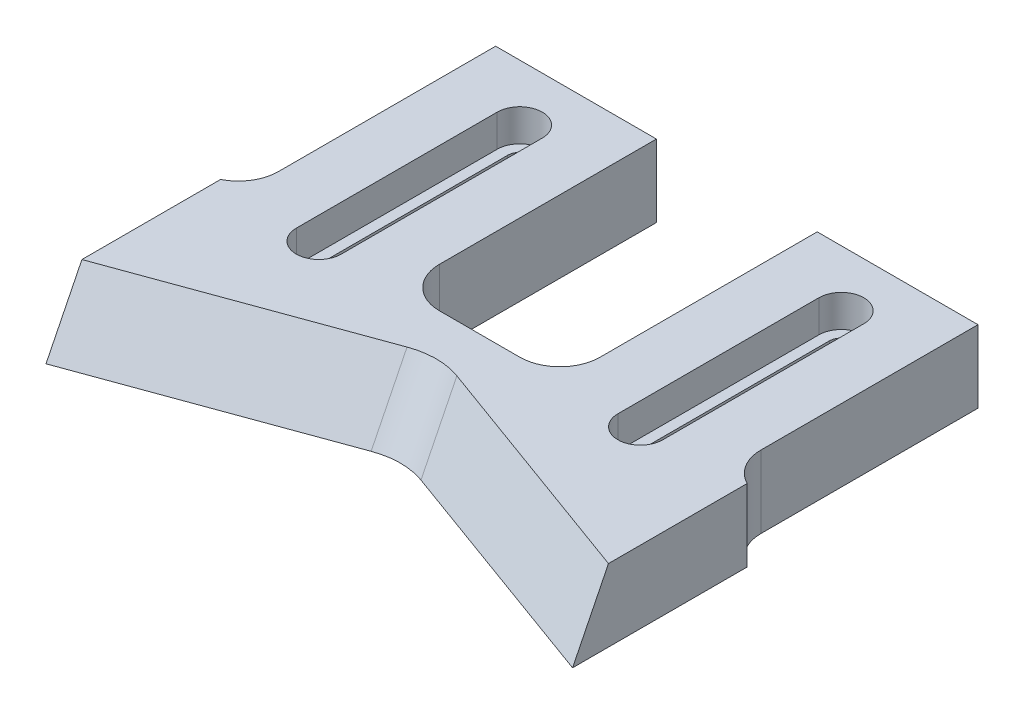
ISO-10303-21;
HEADER;
FILE_DESCRIPTION(('STEP AP214'),'2;1');
FILE_NAME('part.step','',(''),(''),'','','');
FILE_SCHEMA(('AUTOMOTIVE_DESIGN { 1 0 10303 214 1 1 1 1 }'));
ENDSEC;
DATA;
#1=APPLICATION_CONTEXT('core data for automotive mechanical design processes');
#2=APPLICATION_PROTOCOL_DEFINITION('international standard','automotive_design',2000,#1);
#3=PRODUCT_CONTEXT('',#1,'mechanical');
#4=PRODUCT('Part','Part','',(#3));
#5=PRODUCT_RELATED_PRODUCT_CATEGORY('part','',(#4));
#6=PRODUCT_DEFINITION_FORMATION('','',#4);
#7=PRODUCT_DEFINITION_CONTEXT('part definition',#1,'design');
#8=PRODUCT_DEFINITION('design','',#6,#7);
#9=PRODUCT_DEFINITION_SHAPE('','',#8);
#10=(LENGTH_UNIT() NAMED_UNIT(*) SI_UNIT(.MILLI.,.METRE.));
#11=(NAMED_UNIT(*) PLANE_ANGLE_UNIT() SI_UNIT($,.RADIAN.));
#12=(NAMED_UNIT(*) SI_UNIT($,.STERADIAN.) SOLID_ANGLE_UNIT());
#13=UNCERTAINTY_MEASURE_WITH_UNIT(LENGTH_MEASURE(1.E-05),#10,'distance_accuracy_value','');
#14=(GEOMETRIC_REPRESENTATION_CONTEXT(3) GLOBAL_UNCERTAINTY_ASSIGNED_CONTEXT((#13)) GLOBAL_UNIT_ASSIGNED_CONTEXT((#10,
#11,#12)) REPRESENTATION_CONTEXT('',''));
#15=CARTESIAN_POINT('',(0.,0.,0.));
#16=DIRECTION('',(0.,0.,1.));
#17=DIRECTION('',(1.,0.,0.));
#18=AXIS2_PLACEMENT_3D('',#15,#16,#17);
#19=CARTESIAN_POINT('',(57.75,-0.000999999999999265,-48.));
#20=DIRECTION('',(0.,1.,0.));
#21=DIRECTION('',(0.,0.,1.));
#22=AXIS2_PLACEMENT_3D('',#19,#20,#21);
#23=CYLINDRICAL_SURFACE('',#22,1.5);
#24=CARTESIAN_POINT('',(57.75,5.,-48.));
#25=DIRECTION('',(0.,1.,0.));
#26=DIRECTION('',(0.,0.,1.));
#27=AXIS2_PLACEMENT_3D('',#24,#25,#26);
#28=CIRCLE('',#27,1.5);
#29=CARTESIAN_POINT('',(56.25,5.,-48.));
#30=VERTEX_POINT('',#29);
#31=CARTESIAN_POINT('',(59.25,5.,-48.));
#32=VERTEX_POINT('',#31);
#33=EDGE_CURVE('E388',#30,#32,#28,.F.);
#34=ORIENTED_EDGE('',*,*,#33,.F.);
#35=DIRECTION('',(0.,1.,0.));
#36=VECTOR('',#35,1.);
#37=CARTESIAN_POINT('',(56.25,-0.000999999999999265,-48.));
#38=LINE('',#37,#36);
#39=CARTESIAN_POINT('',(56.25,0.,-48.));
#40=VERTEX_POINT('',#39);
#41=EDGE_CURVE('E460',#40,#30,#38,.T.);
#42=ORIENTED_EDGE('',*,*,#41,.F.);
#43=CARTESIAN_POINT('',(57.75,0.,-48.));
#44=DIRECTION('',(0.,-1.,0.));
#45=DIRECTION('',(0.,0.,-1.));
#46=AXIS2_PLACEMENT_3D('',#43,#44,#45);
#47=CIRCLE('',#46,1.5);
#48=CARTESIAN_POINT('',(59.25,0.,-48.));
#49=VERTEX_POINT('',#48);
#50=EDGE_CURVE('E457',#49,#40,#47,.F.);
#51=ORIENTED_EDGE('',*,*,#50,.F.);
#52=DIRECTION('',(0.,1.,0.));
#53=VECTOR('',#52,1.);
#54=CARTESIAN_POINT('',(59.25,-0.000999999999999265,-48.));
#55=LINE('',#54,#53);
#56=EDGE_CURVE('E461',#49,#32,#55,.T.);
#57=ORIENTED_EDGE('',*,*,#56,.T.);
#58=EDGE_LOOP('',(#34,#42,#51,#57));
#59=FACE_BOUND('',#58,.T.);
#60=ADVANCED_FACE('F37',(#59),#23,.F.);
#61=CARTESIAN_POINT('',(59.25,-0.000999999999999265,-48.));
#62=DIRECTION('',(1.,0.,0.));
#63=DIRECTION('',(0.,0.,-1.));
#64=AXIS2_PLACEMENT_3D('',#61,#62,#63);
#65=PLANE('',#64);
#66=DIRECTION('',(0.,0.,1.));
#67=VECTOR('',#66,1.);
#68=CARTESIAN_POINT('',(59.25,5.,-48.));
#69=LINE('',#68,#67);
#70=CARTESIAN_POINT('',(59.25,5.,-23.));
#71=VERTEX_POINT('',#70);
#72=EDGE_CURVE('E386',#32,#71,#69,.T.);
#73=ORIENTED_EDGE('',*,*,#72,.F.);
#74=ORIENTED_EDGE('',*,*,#56,.F.);
#75=DIRECTION('',(0.,0.,-1.));
#76=VECTOR('',#75,1.);
#77=CARTESIAN_POINT('',(59.25,0.,-48.));
#78=LINE('',#77,#76);
#79=CARTESIAN_POINT('',(59.25,0.,-23.));
#80=VERTEX_POINT('',#79);
#81=EDGE_CURVE('E454',#80,#49,#78,.T.);
#82=ORIENTED_EDGE('',*,*,#81,.F.);
#83=DIRECTION('',(0.,1.,0.));
#84=VECTOR('',#83,1.);
#85=CARTESIAN_POINT('',(59.25,-0.000999999999999265,-23.));
#86=LINE('',#85,#84);
#87=EDGE_CURVE('E465',#80,#71,#86,.T.);
#88=ORIENTED_EDGE('',*,*,#87,.T.);
#89=EDGE_LOOP('',(#73,#74,#82,#88));
#90=FACE_BOUND('',#89,.T.);
#91=ADVANCED_FACE('F530',(#90),#65,.F.);
#92=CARTESIAN_POINT('',(57.75,-0.000999999999999265,-23.));
#93=DIRECTION('',(0.,1.,0.));
#94=DIRECTION('',(0.,0.,1.));
#95=AXIS2_PLACEMENT_3D('',#92,#93,#94);
#96=CYLINDRICAL_SURFACE('',#95,1.49999999999999);
#97=CARTESIAN_POINT('',(57.75,5.,-23.));
#98=DIRECTION('',(0.,1.,0.));
#99=DIRECTION('',(0.,0.,1.));
#100=AXIS2_PLACEMENT_3D('',#97,#98,#99);
#101=CIRCLE('',#100,1.49999999999999);
#102=CARTESIAN_POINT('',(56.25,5.,-23.));
#103=VERTEX_POINT('',#102);
#104=EDGE_CURVE('E378',#71,#103,#101,.F.);
#105=ORIENTED_EDGE('',*,*,#104,.F.);
#106=ORIENTED_EDGE('',*,*,#87,.F.);
#107=CARTESIAN_POINT('',(57.75,0.,-23.));
#108=DIRECTION('',(0.,-1.,0.));
#109=DIRECTION('',(0.,0.,-1.));
#110=AXIS2_PLACEMENT_3D('',#107,#108,#109);
#111=CIRCLE('',#110,1.49999999999999);
#112=CARTESIAN_POINT('',(56.25,0.,-23.));
#113=VERTEX_POINT('',#112);
#114=EDGE_CURVE('E449',#113,#80,#111,.F.);
#115=ORIENTED_EDGE('',*,*,#114,.F.);
#116=DIRECTION('',(0.,1.,0.));
#117=VECTOR('',#116,1.);
#118=CARTESIAN_POINT('',(56.25,-0.000999999999999265,-23.));
#119=LINE('',#118,#117);
#120=EDGE_CURVE('E468',#113,#103,#119,.T.);
#121=ORIENTED_EDGE('',*,*,#120,.T.);
#122=EDGE_LOOP('',(#105,#106,#115,#121));
#123=FACE_BOUND('',#122,.T.);
#124=ADVANCED_FACE('F536',(#123),#96,.F.);
#125=CARTESIAN_POINT('',(56.25,-0.000999999999999265,-48.));
#126=DIRECTION('',(-1.,0.,0.));
#127=DIRECTION('',(0.,0.,1.));
#128=AXIS2_PLACEMENT_3D('',#125,#126,#127);
#129=PLANE('',#128);
#130=DIRECTION('',(0.,0.,-1.));
#131=VECTOR('',#130,1.);
#132=CARTESIAN_POINT('',(56.25,5.,-48.));
#133=LINE('',#132,#131);
#134=EDGE_CURVE('E327',#103,#30,#133,.T.);
#135=ORIENTED_EDGE('',*,*,#134,.F.);
#136=ORIENTED_EDGE('',*,*,#120,.F.);
#137=DIRECTION('',(0.,0.,1.));
#138=VECTOR('',#137,1.);
#139=CARTESIAN_POINT('',(56.25,0.,-48.));
#140=LINE('',#139,#138);
#141=EDGE_CURVE('E464',#40,#113,#140,.T.);
#142=ORIENTED_EDGE('',*,*,#141,.F.);
#143=ORIENTED_EDGE('',*,*,#41,.T.);
#144=EDGE_LOOP('',(#135,#136,#142,#143));
#145=FACE_BOUND('',#144,.T.);
#146=ADVANCED_FACE('F542',(#145),#129,.F.);
#147=CARTESIAN_POINT('',(17.75,-0.000999999999999265,-48.));
#148=DIRECTION('',(0.,1.,0.));
#149=DIRECTION('',(0.,0.,1.));
#150=AXIS2_PLACEMENT_3D('',#147,#148,#149);
#151=CYLINDRICAL_SURFACE('',#150,1.5);
#152=CARTESIAN_POINT('',(17.75,5.,-48.));
#153=DIRECTION('',(0.,1.,0.));
#154=DIRECTION('',(0.,0.,1.));
#155=AXIS2_PLACEMENT_3D('',#152,#153,#154);
#156=CIRCLE('',#155,1.5);
#157=CARTESIAN_POINT('',(16.25,5.,-48.));
#158=VERTEX_POINT('',#157);
#159=CARTESIAN_POINT('',(19.25,5.,-48.));
#160=VERTEX_POINT('',#159);
#161=EDGE_CURVE('E426',#158,#160,#156,.F.);
#162=ORIENTED_EDGE('',*,*,#161,.F.);
#163=DIRECTION('',(0.,1.,0.));
#164=VECTOR('',#163,1.);
#165=CARTESIAN_POINT('',(16.25,-0.000999999999999265,-48.));
#166=LINE('',#165,#164);
#167=CARTESIAN_POINT('',(16.25,0.,-48.));
#168=VERTEX_POINT('',#167);
#169=EDGE_CURVE('E484',#168,#158,#166,.T.);
#170=ORIENTED_EDGE('',*,*,#169,.F.);
#171=CARTESIAN_POINT('',(17.75,0.,-48.));
#172=DIRECTION('',(0.,-1.,0.));
#173=DIRECTION('',(0.,0.,-1.));
#174=AXIS2_PLACEMENT_3D('',#171,#172,#173);
#175=CIRCLE('',#174,1.5);
#176=CARTESIAN_POINT('',(19.25,0.,-48.));
#177=VERTEX_POINT('',#176);
#178=EDGE_CURVE('E481',#177,#168,#175,.F.);
#179=ORIENTED_EDGE('',*,*,#178,.F.);
#180=DIRECTION('',(0.,1.,0.));
#181=VECTOR('',#180,1.);
#182=CARTESIAN_POINT('',(19.25,-0.000999999999999265,-48.));
#183=LINE('',#182,#181);
#184=EDGE_CURVE('E485',#177,#160,#183,.T.);
#185=ORIENTED_EDGE('',*,*,#184,.T.);
#186=EDGE_LOOP('',(#162,#170,#179,#185));
#187=FACE_BOUND('',#186,.T.);
#188=ADVANCED_FACE('F548',(#187),#151,.F.);
#189=CARTESIAN_POINT('',(19.25,-0.000999999999999265,-48.));
#190=DIRECTION('',(1.,0.,0.));
#191=DIRECTION('',(0.,0.,-1.));
#192=AXIS2_PLACEMENT_3D('',#189,#190,#191);
#193=PLANE('',#192);
#194=DIRECTION('',(0.,0.,1.));
#195=VECTOR('',#194,1.);
#196=CARTESIAN_POINT('',(19.25,5.,-48.));
#197=LINE('',#196,#195);
#198=CARTESIAN_POINT('',(19.25,5.,-23.));
#199=VERTEX_POINT('',#198);
#200=EDGE_CURVE('E424',#160,#199,#197,.T.);
#201=ORIENTED_EDGE('',*,*,#200,.F.);
#202=ORIENTED_EDGE('',*,*,#184,.F.);
#203=DIRECTION('',(0.,0.,-1.));
#204=VECTOR('',#203,1.);
#205=CARTESIAN_POINT('',(19.25,0.,-48.));
#206=LINE('',#205,#204);
#207=CARTESIAN_POINT('',(19.25,0.,-23.));
#208=VERTEX_POINT('',#207);
#209=EDGE_CURVE('E478',#208,#177,#206,.T.);
#210=ORIENTED_EDGE('',*,*,#209,.F.);
#211=DIRECTION('',(0.,1.,0.));
#212=VECTOR('',#211,1.);
#213=CARTESIAN_POINT('',(19.25,-0.000999999999999265,-23.));
#214=LINE('',#213,#212);
#215=EDGE_CURVE('E488',#208,#199,#214,.T.);
#216=ORIENTED_EDGE('',*,*,#215,.T.);
#217=EDGE_LOOP('',(#201,#202,#210,#216));
#218=FACE_BOUND('',#217,.T.);
#219=ADVANCED_FACE('F544',(#218),#193,.F.);
#220=CARTESIAN_POINT('',(17.75,-0.000999999999999265,-23.));
#221=DIRECTION('',(0.,1.,0.));
#222=DIRECTION('',(0.,0.,1.));
#223=AXIS2_PLACEMENT_3D('',#220,#221,#222);
#224=CYLINDRICAL_SURFACE('',#223,1.5);
#225=CARTESIAN_POINT('',(17.75,5.,-23.));
#226=DIRECTION('',(0.,1.,0.));
#227=DIRECTION('',(0.,0.,1.));
#228=AXIS2_PLACEMENT_3D('',#225,#226,#227);
#229=CIRCLE('',#228,1.5);
#230=CARTESIAN_POINT('',(16.25,5.,-23.));
#231=VERTEX_POINT('',#230);
#232=EDGE_CURVE('E416',#199,#231,#229,.F.);
#233=ORIENTED_EDGE('',*,*,#232,.F.);
#234=ORIENTED_EDGE('',*,*,#215,.F.);
#235=CARTESIAN_POINT('',(17.75,0.,-23.));
#236=DIRECTION('',(0.,-1.,0.));
#237=DIRECTION('',(0.,0.,-1.));
#238=AXIS2_PLACEMENT_3D('',#235,#236,#237);
#239=CIRCLE('',#238,1.5);
#240=CARTESIAN_POINT('',(16.25,0.,-23.));
#241=VERTEX_POINT('',#240);
#242=EDGE_CURVE('E475',#241,#208,#239,.F.);
#243=ORIENTED_EDGE('',*,*,#242,.F.);
#244=DIRECTION('',(0.,1.,0.));
#245=VECTOR('',#244,1.);
#246=CARTESIAN_POINT('',(16.25,-0.000999999999999265,-23.));
#247=LINE('',#246,#245);
#248=EDGE_CURVE('E491',#241,#231,#247,.T.);
#249=ORIENTED_EDGE('',*,*,#248,.T.);
#250=EDGE_LOOP('',(#233,#234,#243,#249));
#251=FACE_BOUND('',#250,.T.);
#252=ADVANCED_FACE('F547',(#251),#224,.F.);
#253=CARTESIAN_POINT('',(16.25,-0.000999999999999265,-48.));
#254=DIRECTION('',(-1.,0.,0.));
#255=DIRECTION('',(0.,0.,1.));
#256=AXIS2_PLACEMENT_3D('',#253,#254,#255);
#257=PLANE('',#256);
#258=DIRECTION('',(0.,0.,-1.));
#259=VECTOR('',#258,1.);
#260=CARTESIAN_POINT('',(16.25,5.,-48.));
#261=LINE('',#260,#259);
#262=EDGE_CURVE('E325',#231,#158,#261,.T.);
#263=ORIENTED_EDGE('',*,*,#262,.F.);
#264=ORIENTED_EDGE('',*,*,#248,.F.);
#265=DIRECTION('',(0.,0.,1.));
#266=VECTOR('',#265,1.);
#267=CARTESIAN_POINT('',(16.25,0.,-48.));
#268=LINE('',#267,#266);
#269=EDGE_CURVE('E275',#168,#241,#268,.T.);
#270=ORIENTED_EDGE('',*,*,#269,.F.);
#271=ORIENTED_EDGE('',*,*,#169,.T.);
#272=EDGE_LOOP('',(#263,#264,#270,#271));
#273=FACE_BOUND('',#272,.T.);
#274=ADVANCED_FACE('F552',(#273),#257,.F.);
#275=CARTESIAN_POINT('',(0.,9.,-55.));
#276=DIRECTION('',(0.,0.,1.));
#277=DIRECTION('',(1.,0.,0.));
#278=AXIS2_PLACEMENT_3D('',#275,#276,#277);
#279=PLANE('',#278);
#280=DIRECTION('',(-1.,0.,0.));
#281=VECTOR('',#280,1.);
#282=CARTESIAN_POINT('',(0.,0.,-55.));
#283=LINE('',#282,#281);
#284=CARTESIAN_POINT('',(27.75,0.,-55.));
#285=VERTEX_POINT('',#284);
#286=CARTESIAN_POINT('',(7.74999999999998,0.,-55.));
#287=VERTEX_POINT('',#286);
#288=EDGE_CURVE('E269',#285,#287,#283,.T.);
#289=ORIENTED_EDGE('',*,*,#288,.T.);
#290=DIRECTION('',(0.,1.,0.));
#291=VECTOR('',#290,1.);
#292=CARTESIAN_POINT('',(7.74999999999998,-1.,-55.));
#293=LINE('',#292,#291);
#294=CARTESIAN_POINT('',(7.74999999999998,9.,-55.));
#295=VERTEX_POINT('',#294);
#296=EDGE_CURVE('E435',#287,#295,#293,.T.);
#297=ORIENTED_EDGE('',*,*,#296,.T.);
#298=DIRECTION('',(-1.,0.,0.));
#299=VECTOR('',#298,1.);
#300=CARTESIAN_POINT('',(0.,9.,-55.));
#301=LINE('',#300,#299);
#302=CARTESIAN_POINT('',(27.75,9.,-55.));
#303=VERTEX_POINT('',#302);
#304=EDGE_CURVE('E279',#303,#295,#301,.T.);
#305=ORIENTED_EDGE('',*,*,#304,.F.);
#306=DIRECTION('',(0.,1.,0.));
#307=VECTOR('',#306,1.);
#308=CARTESIAN_POINT('',(27.75,-1.,-55.));
#309=LINE('',#308,#307);
#310=EDGE_CURVE('E447',#285,#303,#309,.T.);
#311=ORIENTED_EDGE('',*,*,#310,.F.);
#312=EDGE_LOOP('',(#289,#297,#305,#311));
#313=FACE_BOUND('',#312,.T.);
#314=ADVANCED_FACE('F509',(#313),#279,.F.);
#315=CARTESIAN_POINT('',(67.75,9.,-55.));
#316=VERTEX_POINT('',#315);
#317=CARTESIAN_POINT('',(47.75,9.,-55.));
#318=VERTEX_POINT('',#317);
#319=EDGE_CURVE('E284',#316,#318,#301,.T.);
#320=ORIENTED_EDGE('',*,*,#319,.F.);
#321=DIRECTION('',(0.,1.,0.));
#322=VECTOR('',#321,1.);
#323=CARTESIAN_POINT('',(67.75,-1.,-55.));
#324=LINE('',#323,#322);
#325=CARTESIAN_POINT('',(67.75,0.,-55.));
#326=VERTEX_POINT('',#325);
#327=EDGE_CURVE('E431',#326,#316,#324,.T.);
#328=ORIENTED_EDGE('',*,*,#327,.F.);
#329=CARTESIAN_POINT('',(47.75,0.,-55.));
#330=VERTEX_POINT('',#329);
#331=EDGE_CURVE('E273',#326,#330,#283,.T.);
#332=ORIENTED_EDGE('',*,*,#331,.T.);
#333=DIRECTION('',(0.,1.,0.));
#334=VECTOR('',#333,1.);
#335=CARTESIAN_POINT('',(47.75,-1.,-55.));
#336=LINE('',#335,#334);
#337=EDGE_CURVE('E446',#330,#318,#336,.T.);
#338=ORIENTED_EDGE('',*,*,#337,.T.);
#339=EDGE_LOOP('',(#320,#328,#332,#338));
#340=FACE_BOUND('',#339,.T.);
#341=ADVANCED_FACE('F562',(#340),#279,.F.);
#342=CARTESIAN_POINT('',(0.,9.,0.));
#343=DIRECTION('',(0.,-1.,0.));
#344=DIRECTION('',(0.,0.,-1.));
#345=AXIS2_PLACEMENT_3D('',#342,#343,#344);
#346=PLANE('',#345);
#347=DIRECTION('',(0.,0.,1.));
#348=VECTOR('',#347,1.);
#349=CARTESIAN_POINT('',(54.95,9.,-48.));
#350=LINE('',#349,#348);
#351=CARTESIAN_POINT('',(54.95,9.,-48.));
#352=VERTEX_POINT('',#351);
#353=CARTESIAN_POINT('',(54.95,9.,-23.));
#354=VERTEX_POINT('',#353);
#355=EDGE_CURVE('E368',#352,#354,#350,.T.);
#356=ORIENTED_EDGE('',*,*,#355,.F.);
#357=CARTESIAN_POINT('',(57.75,9.,-48.));
#358=DIRECTION('',(0.,1.,0.));
#359=DIRECTION('',(0.,0.,1.));
#360=AXIS2_PLACEMENT_3D('',#357,#358,#359);
#361=CIRCLE('',#360,2.8);
#362=CARTESIAN_POINT('',(60.55,9.,-48.));
#363=VERTEX_POINT('',#362);
#364=EDGE_CURVE('E352',#363,#352,#361,.T.);
#365=ORIENTED_EDGE('',*,*,#364,.F.);
#366=DIRECTION('',(0.,0.,-1.));
#367=VECTOR('',#366,1.);
#368=CARTESIAN_POINT('',(60.55,9.,-48.));
#369=LINE('',#368,#367);
#370=CARTESIAN_POINT('',(60.55,9.,-23.));
#371=VERTEX_POINT('',#370);
#372=EDGE_CURVE('E357',#371,#363,#369,.T.);
#373=ORIENTED_EDGE('',*,*,#372,.F.);
#374=CARTESIAN_POINT('',(57.75,9.,-23.));
#375=DIRECTION('',(0.,1.,0.));
#376=DIRECTION('',(0.,0.,1.));
#377=AXIS2_PLACEMENT_3D('',#374,#375,#376);
#378=CIRCLE('',#377,2.79999999999999);
#379=EDGE_CURVE('E371',#354,#371,#378,.T.);
#380=ORIENTED_EDGE('',*,*,#379,.F.);
#381=EDGE_LOOP('',(#356,#365,#373,#380));
#382=FACE_BOUND('',#381,.T.);
#383=DIRECTION('',(0.,0.,1.));
#384=VECTOR('',#383,1.);
#385=CARTESIAN_POINT('',(14.95,9.,-48.));
#386=LINE('',#385,#384);
#387=CARTESIAN_POINT('',(14.95,9.,-48.));
#388=VERTEX_POINT('',#387);
#389=CARTESIAN_POINT('',(14.95,9.,-23.));
#390=VERTEX_POINT('',#389);
#391=EDGE_CURVE('E406',#388,#390,#386,.T.);
#392=ORIENTED_EDGE('',*,*,#391,.F.);
#393=CARTESIAN_POINT('',(17.75,9.,-48.));
#394=DIRECTION('',(0.,1.,0.));
#395=DIRECTION('',(0.,0.,1.));
#396=AXIS2_PLACEMENT_3D('',#393,#394,#395);
#397=CIRCLE('',#396,2.8);
#398=CARTESIAN_POINT('',(20.55,9.,-48.));
#399=VERTEX_POINT('',#398);
#400=EDGE_CURVE('E390',#399,#388,#397,.T.);
#401=ORIENTED_EDGE('',*,*,#400,.F.);
#402=DIRECTION('',(0.,0.,-1.));
#403=VECTOR('',#402,1.);
#404=CARTESIAN_POINT('',(20.55,9.,-48.));
#405=LINE('',#404,#403);
#406=CARTESIAN_POINT('',(20.55,9.,-23.));
#407=VERTEX_POINT('',#406);
#408=EDGE_CURVE('E395',#407,#399,#405,.T.);
#409=ORIENTED_EDGE('',*,*,#408,.F.);
#410=CARTESIAN_POINT('',(17.75,9.,-23.));
#411=DIRECTION('',(0.,1.,0.));
#412=DIRECTION('',(0.,0.,1.));
#413=AXIS2_PLACEMENT_3D('',#410,#411,#412);
#414=CIRCLE('',#413,2.8);
#415=EDGE_CURVE('E409',#390,#407,#414,.T.);
#416=ORIENTED_EDGE('',*,*,#415,.F.);
#417=EDGE_LOOP('',(#392,#401,#409,#416));
#418=FACE_BOUND('',#417,.T.);
#419=DIRECTION('',(0.939692620785907,0.,0.342020143325673));
#420=VECTOR('',#419,1.);
#421=CARTESIAN_POINT('',(10.2672017809431,9.,-28.208905054125));
#422=LINE('',#421,#420);
#423=CARTESIAN_POINT('',(40.8497551921945,9.,-17.077765924573));
#424=VERTEX_POINT('',#423);
#425=CARTESIAN_POINT('',(70.5,9.,-6.28595937582563));
#426=VERTEX_POINT('',#425);
#427=EDGE_CURVE('E331',#424,#426,#422,.T.);
#428=ORIENTED_EDGE('',*,*,#427,.T.);
#429=DIRECTION('',(0.,0.,1.));
#430=VECTOR('',#429,1.);
#431=CARTESIAN_POINT('',(70.5,9.,0.));
#432=LINE('',#431,#430);
#433=CARTESIAN_POINT('',(70.5,9.,-23.5348572251271));
#434=VERTEX_POINT('',#433);
#435=EDGE_CURVE('E52',#434,#426,#432,.T.);
#436=ORIENTED_EDGE('',*,*,#435,.F.);
#437=CARTESIAN_POINT('',(72.75,9.,-28.));
#438=DIRECTION('',(0.,-1.,0.));
#439=DIRECTION('',(0.,0.,-1.));
#440=AXIS2_PLACEMENT_3D('',#437,#438,#439);
#441=CIRCLE('',#440,5.);
#442=CARTESIAN_POINT('',(67.75,9.,-28.));
#443=VERTEX_POINT('',#442);
#444=EDGE_CURVE('E309',#434,#443,#441,.T.);
#445=ORIENTED_EDGE('',*,*,#444,.T.);
#446=DIRECTION('',(0.,0.,1.));
#447=VECTOR('',#446,1.);
#448=CARTESIAN_POINT('',(67.75,9.,-55.));
#449=LINE('',#448,#447);
#450=EDGE_CURVE('E428',#316,#443,#449,.T.);
#451=ORIENTED_EDGE('',*,*,#450,.F.);
#452=ORIENTED_EDGE('',*,*,#319,.T.);
#453=DIRECTION('',(0.,0.,-1.));
#454=VECTOR('',#453,1.);
#455=CARTESIAN_POINT('',(47.75,9.,-55.));
#456=LINE('',#455,#454);
#457=CARTESIAN_POINT('',(47.75,9.,-28.));
#458=VERTEX_POINT('',#457);
#459=EDGE_CURVE('E444',#458,#318,#456,.T.);
#460=ORIENTED_EDGE('',*,*,#459,.F.);
#461=CARTESIAN_POINT('',(42.75,9.,-28.));
#462=DIRECTION('',(0.,-1.,0.));
#463=DIRECTION('',(0.,0.,-1.));
#464=AXIS2_PLACEMENT_3D('',#461,#462,#463);
#465=CIRCLE('',#464,5.);
#466=CARTESIAN_POINT('',(42.75,9.,-23.));
#467=VERTEX_POINT('',#466);
#468=EDGE_CURVE('E312',#458,#467,#465,.T.);
#469=ORIENTED_EDGE('',*,*,#468,.T.);
#470=DIRECTION('',(1.,0.,0.));
#471=VECTOR('',#470,1.);
#472=CARTESIAN_POINT('',(27.75,9.,-23.));
#473=LINE('',#472,#471);
#474=CARTESIAN_POINT('',(32.75,9.,-23.));
#475=VERTEX_POINT('',#474);
#476=EDGE_CURVE('E441',#475,#467,#473,.T.);
#477=ORIENTED_EDGE('',*,*,#476,.F.);
#478=CARTESIAN_POINT('',(32.75,9.,-28.));
#479=DIRECTION('',(0.,-1.,0.));
#480=DIRECTION('',(0.,0.,-1.));
#481=AXIS2_PLACEMENT_3D('',#478,#479,#480);
#482=CIRCLE('',#481,5.);
#483=CARTESIAN_POINT('',(27.75,9.,-28.));
#484=VERTEX_POINT('',#483);
#485=EDGE_CURVE('E316',#475,#484,#482,.T.);
#486=ORIENTED_EDGE('',*,*,#485,.T.);
#487=DIRECTION('',(0.,0.,1.));
#488=VECTOR('',#487,1.);
#489=CARTESIAN_POINT('',(27.75,9.,-55.));
#490=LINE('',#489,#488);
#491=EDGE_CURVE('E438',#303,#484,#490,.T.);
#492=ORIENTED_EDGE('',*,*,#491,.F.);
#493=ORIENTED_EDGE('',*,*,#304,.T.);
#494=DIRECTION('',(0.,0.,-1.));
#495=VECTOR('',#494,1.);
#496=CARTESIAN_POINT('',(7.74999999999998,9.,-55.));
#497=LINE('',#496,#495);
#498=CARTESIAN_POINT('',(7.74999999999998,9.,-28.));
#499=VERTEX_POINT('',#498);
#500=EDGE_CURVE('E433',#499,#295,#497,.T.);
#501=ORIENTED_EDGE('',*,*,#500,.F.);
#502=CARTESIAN_POINT('',(2.74999999999998,9.,-28.));
#503=DIRECTION('',(0.,-1.,0.));
#504=DIRECTION('',(0.,0.,-1.));
#505=AXIS2_PLACEMENT_3D('',#502,#503,#504);
#506=CIRCLE('',#505,5.);
#507=CARTESIAN_POINT('',(5.,9.,-23.5348572251271));
#508=VERTEX_POINT('',#507);
#509=EDGE_CURVE('E320',#499,#508,#506,.T.);
#510=ORIENTED_EDGE('',*,*,#509,.T.);
#511=DIRECTION('',(0.,0.,-1.));
#512=VECTOR('',#511,1.);
#513=CARTESIAN_POINT('',(5.,9.,0.));
#514=LINE('',#513,#512);
#515=CARTESIAN_POINT('',(5.,9.,-6.28595937582565));
#516=VERTEX_POINT('',#515);
#517=EDGE_CURVE('E350',#516,#508,#514,.T.);
#518=ORIENTED_EDGE('',*,*,#517,.F.);
#519=DIRECTION('',(0.939692620785907,0.,-0.342020143325673));
#520=VECTOR('',#519,1.);
#521=CARTESIAN_POINT('',(-1.43537950868428,9.,-3.94367278845788));
#522=LINE('',#521,#520);
#523=CARTESIAN_POINT('',(34.6502448078055,9.,-17.077765924573));
#524=VERTEX_POINT('',#523);
#525=EDGE_CURVE('E329',#516,#524,#522,.T.);
#526=ORIENTED_EDGE('',*,*,#525,.T.);
#527=CARTESIAN_POINT('',(37.75,9.,-6.4640819880378));
#528=DIRECTION('',(0.,-1.,0.));
#529=DIRECTION('',(0.,0.,-1.));
#530=AXIS2_PLACEMENT_3D('',#527,#528,#529);
#531=ELLIPSE('',#530,11.1635497305068,10.);
#532=EDGE_CURVE('E11',#524,#424,#531,.T.);
#533=ORIENTED_EDGE('',*,*,#532,.T.);
#534=EDGE_LOOP('',(#428,#436,#445,#451,#452,#460,#469,#477,#486,#492,#493,#501,#510,#518,#526,#533));
#535=FACE_BOUND('',#534,.T.);
#536=ADVANCED_FACE('F506',(#382,#418,#535),#346,.F.);
#537=CARTESIAN_POINT('',(0.,0.,0.));
#538=DIRECTION('',(0.,-1.,0.));
#539=DIRECTION('',(0.,0.,-1.));
#540=AXIS2_PLACEMENT_3D('',#537,#538,#539);
#541=PLANE('',#540);
#542=DIRECTION('',(0.,0.,1.));
#543=VECTOR('',#542,1.);
#544=CARTESIAN_POINT('',(70.5,0.,0.));
#545=LINE('',#544,#543);
#546=CARTESIAN_POINT('',(70.5,0.,-23.5348572251271));
#547=VERTEX_POINT('',#546);
#548=CARTESIAN_POINT('',(70.5,0.,-1.81985117133105));
#549=VERTEX_POINT('',#548);
#550=EDGE_CURVE('E245',#547,#549,#545,.T.);
#551=ORIENTED_EDGE('',*,*,#550,.T.);
#552=DIRECTION('',(0.939692620785907,0.,0.342020143325673));
#553=VECTOR('',#552,1.);
#554=CARTESIAN_POINT('',(75.5,0.,0.));
#555=LINE('',#554,#553);
#556=CARTESIAN_POINT('',(40.8497551921945,0.,-12.6116577200784));
#557=VERTEX_POINT('',#556);
#558=EDGE_CURVE('E259',#557,#549,#555,.T.);
#559=ORIENTED_EDGE('',*,*,#558,.F.);
#560=CARTESIAN_POINT('',(37.75,0.,-1.99797378354322));
#561=DIRECTION('',(0.,-1.,0.));
#562=DIRECTION('',(0.,0.,-1.));
#563=AXIS2_PLACEMENT_3D('',#560,#561,#562);
#564=ELLIPSE('',#563,11.1635497305068,10.);
#565=CARTESIAN_POINT('',(34.6502448078055,0.,-12.6116577200784));
#566=VERTEX_POINT('',#565);
#567=EDGE_CURVE('E45',#557,#566,#564,.F.);
#568=ORIENTED_EDGE('',*,*,#567,.T.);
#569=DIRECTION('',(0.939692620785907,0.,-0.342020143325673));
#570=VECTOR('',#569,1.);
#571=CARTESIAN_POINT('',(37.75,0.,-13.7398763435493));
#572=LINE('',#571,#570);
#573=CARTESIAN_POINT('',(5.00000000000001,0.,-1.81985117133105));
#574=VERTEX_POINT('',#573);
#575=EDGE_CURVE('E270',#574,#566,#572,.T.);
#576=ORIENTED_EDGE('',*,*,#575,.F.);
#577=DIRECTION('',(0.,0.,-1.));
#578=VECTOR('',#577,1.);
#579=CARTESIAN_POINT('',(5.,0.,0.));
#580=LINE('',#579,#578);
#581=CARTESIAN_POINT('',(5.,0.,-23.5348572251271));
#582=VERTEX_POINT('',#581);
#583=EDGE_CURVE('E60',#574,#582,#580,.T.);
#584=ORIENTED_EDGE('',*,*,#583,.T.);
#585=CARTESIAN_POINT('',(2.74999999999998,0.,-28.));
#586=DIRECTION('',(0.,-1.,0.));
#587=DIRECTION('',(0.,0.,-1.));
#588=AXIS2_PLACEMENT_3D('',#585,#586,#587);
#589=CIRCLE('',#588,5.);
#590=CARTESIAN_POINT('',(7.74999999999998,0.,-28.));
#591=VERTEX_POINT('',#590);
#592=EDGE_CURVE('E323',#582,#591,#589,.F.);
#593=ORIENTED_EDGE('',*,*,#592,.T.);
#594=DIRECTION('',(0.,0.,1.));
#595=VECTOR('',#594,1.);
#596=CARTESIAN_POINT('',(7.74999999999998,0.,0.));
#597=LINE('',#596,#595);
#598=EDGE_CURVE('E289',#287,#591,#597,.T.);
#599=ORIENTED_EDGE('',*,*,#598,.F.);
#600=ORIENTED_EDGE('',*,*,#288,.F.);
#601=DIRECTION('',(0.,0.,-1.));
#602=VECTOR('',#601,1.);
#603=CARTESIAN_POINT('',(27.75,0.,0.));
#604=LINE('',#603,#602);
#605=CARTESIAN_POINT('',(27.75,0.,-28.));
#606=VERTEX_POINT('',#605);
#607=EDGE_CURVE('E287',#606,#285,#604,.T.);
#608=ORIENTED_EDGE('',*,*,#607,.F.);
#609=CARTESIAN_POINT('',(32.75,0.,-28.));
#610=DIRECTION('',(0.,-1.,0.));
#611=DIRECTION('',(0.,0.,-1.));
#612=AXIS2_PLACEMENT_3D('',#609,#610,#611);
#613=CIRCLE('',#612,5.);
#614=CARTESIAN_POINT('',(32.75,0.,-23.));
#615=VERTEX_POINT('',#614);
#616=EDGE_CURVE('E318',#606,#615,#613,.F.);
#617=ORIENTED_EDGE('',*,*,#616,.T.);
#618=DIRECTION('',(-1.,0.,0.));
#619=VECTOR('',#618,1.);
#620=CARTESIAN_POINT('',(0.,0.,-23.));
#621=LINE('',#620,#619);
#622=CARTESIAN_POINT('',(42.75,0.,-23.));
#623=VERTEX_POINT('',#622);
#624=EDGE_CURVE('E280',#623,#615,#621,.T.);
#625=ORIENTED_EDGE('',*,*,#624,.F.);
#626=CARTESIAN_POINT('',(42.75,0.,-28.));
#627=DIRECTION('',(0.,-1.,0.));
#628=DIRECTION('',(0.,0.,-1.));
#629=AXIS2_PLACEMENT_3D('',#626,#627,#628);
#630=CIRCLE('',#629,5.);
#631=CARTESIAN_POINT('',(47.75,0.,-28.));
#632=VERTEX_POINT('',#631);
#633=EDGE_CURVE('E314',#623,#632,#630,.F.);
#634=ORIENTED_EDGE('',*,*,#633,.T.);
#635=DIRECTION('',(0.,0.,1.));
#636=VECTOR('',#635,1.);
#637=CARTESIAN_POINT('',(47.75,0.,0.));
#638=LINE('',#637,#636);
#639=EDGE_CURVE('E283',#330,#632,#638,.T.);
#640=ORIENTED_EDGE('',*,*,#639,.F.);
#641=ORIENTED_EDGE('',*,*,#331,.F.);
#642=DIRECTION('',(0.,0.,-1.));
#643=VECTOR('',#642,1.);
#644=CARTESIAN_POINT('',(67.75,0.,0.));
#645=LINE('',#644,#643);
#646=CARTESIAN_POINT('',(67.75,0.,-28.));
#647=VERTEX_POINT('',#646);
#648=EDGE_CURVE('E292',#647,#326,#645,.T.);
#649=ORIENTED_EDGE('',*,*,#648,.F.);
#650=CARTESIAN_POINT('',(72.75,0.,-28.));
#651=DIRECTION('',(0.,-1.,0.));
#652=DIRECTION('',(0.,0.,-1.));
#653=AXIS2_PLACEMENT_3D('',#650,#651,#652);
#654=CIRCLE('',#653,5.);
#655=EDGE_CURVE('E262',#647,#547,#654,.F.);
#656=ORIENTED_EDGE('',*,*,#655,.T.);
#657=EDGE_LOOP('',(#551,#559,#568,#576,#584,#593,#599,#600,#608,#617,#625,#634,#640,#641,#649,#656));
#658=FACE_BOUND('',#657,.T.);
#659=ORIENTED_EDGE('',*,*,#50,.T.);
#660=ORIENTED_EDGE('',*,*,#141,.T.);
#661=ORIENTED_EDGE('',*,*,#114,.T.);
#662=ORIENTED_EDGE('',*,*,#81,.T.);
#663=EDGE_LOOP('',(#659,#660,#661,#662));
#664=FACE_BOUND('',#663,.T.);
#665=ORIENTED_EDGE('',*,*,#178,.T.);
#666=ORIENTED_EDGE('',*,*,#269,.T.);
#667=ORIENTED_EDGE('',*,*,#242,.T.);
#668=ORIENTED_EDGE('',*,*,#209,.T.);
#669=EDGE_LOOP('',(#665,#666,#667,#668));
#670=FACE_BOUND('',#669,.T.);
#671=ADVANCED_FACE('F256',(#658,#664,#670),#541,.T.);
#672=CARTESIAN_POINT('',(27.75,-1.,-55.));
#673=DIRECTION('',(-1.,0.,0.));
#674=DIRECTION('',(0.,0.,1.));
#675=AXIS2_PLACEMENT_3D('',#672,#673,#674);
#676=PLANE('',#675);
#677=ORIENTED_EDGE('',*,*,#491,.T.);
#678=DIRECTION('',(0.,1.,0.));
#679=VECTOR('',#678,1.);
#680=CARTESIAN_POINT('',(27.75,0.,-28.));
#681=LINE('',#680,#679);
#682=EDGE_CURVE('E304',#484,#606,#681,.F.);
#683=ORIENTED_EDGE('',*,*,#682,.T.);
#684=ORIENTED_EDGE('',*,*,#607,.T.);
#685=ORIENTED_EDGE('',*,*,#310,.T.);
#686=EDGE_LOOP('',(#677,#683,#684,#685));
#687=FACE_BOUND('',#686,.T.);
#688=ADVANCED_FACE('F566',(#687),#676,.F.);
#689=CARTESIAN_POINT('',(47.75,-1.,-55.));
#690=DIRECTION('',(1.,0.,0.));
#691=DIRECTION('',(0.,0.,-1.));
#692=AXIS2_PLACEMENT_3D('',#689,#690,#691);
#693=PLANE('',#692);
#694=ORIENTED_EDGE('',*,*,#639,.T.);
#695=DIRECTION('',(0.,1.,0.));
#696=VECTOR('',#695,1.);
#697=CARTESIAN_POINT('',(47.75,9.,-28.));
#698=LINE('',#697,#696);
#699=EDGE_CURVE('E296',#632,#458,#698,.T.);
#700=ORIENTED_EDGE('',*,*,#699,.T.);
#701=ORIENTED_EDGE('',*,*,#459,.T.);
#702=ORIENTED_EDGE('',*,*,#337,.F.);
#703=EDGE_LOOP('',(#694,#700,#701,#702));
#704=FACE_BOUND('',#703,.T.);
#705=ADVANCED_FACE('F633',(#704),#693,.F.);
#706=CARTESIAN_POINT('',(27.75,-1.,-23.));
#707=DIRECTION('',(0.,0.,1.));
#708=DIRECTION('',(1.,0.,0.));
#709=AXIS2_PLACEMENT_3D('',#706,#707,#708);
#710=PLANE('',#709);
#711=ORIENTED_EDGE('',*,*,#476,.T.);
#712=DIRECTION('',(0.,1.,0.));
#713=VECTOR('',#712,1.);
#714=CARTESIAN_POINT('',(42.75,0.,-23.));
#715=LINE('',#714,#713);
#716=EDGE_CURVE('E302',#467,#623,#715,.F.);
#717=ORIENTED_EDGE('',*,*,#716,.T.);
#718=ORIENTED_EDGE('',*,*,#624,.T.);
#719=DIRECTION('',(0.,1.,0.));
#720=VECTOR('',#719,1.);
#721=CARTESIAN_POINT('',(32.75,9.,-23.));
#722=LINE('',#721,#720);
#723=EDGE_CURVE('E299',#615,#475,#722,.T.);
#724=ORIENTED_EDGE('',*,*,#723,.T.);
#725=EDGE_LOOP('',(#711,#717,#718,#724));
#726=FACE_BOUND('',#725,.T.);
#727=ADVANCED_FACE('F632',(#726),#710,.F.);
#728=CARTESIAN_POINT('',(7.74999999999998,-1.,-55.));
#729=DIRECTION('',(1.,0.,0.));
#730=DIRECTION('',(0.,0.,-1.));
#731=AXIS2_PLACEMENT_3D('',#728,#729,#730);
#732=PLANE('',#731);
#733=ORIENTED_EDGE('',*,*,#598,.T.);
#734=DIRECTION('',(0.,1.,0.));
#735=VECTOR('',#734,1.);
#736=CARTESIAN_POINT('',(7.74999999999998,9.,-28.));
#737=LINE('',#736,#735);
#738=EDGE_CURVE('E306',#591,#499,#737,.T.);
#739=ORIENTED_EDGE('',*,*,#738,.T.);
#740=ORIENTED_EDGE('',*,*,#500,.T.);
#741=ORIENTED_EDGE('',*,*,#296,.F.);
#742=EDGE_LOOP('',(#733,#739,#740,#741));
#743=FACE_BOUND('',#742,.T.);
#744=ADVANCED_FACE('F513',(#743),#732,.F.);
#745=CARTESIAN_POINT('',(67.75,-1.,-55.));
#746=DIRECTION('',(-1.,0.,0.));
#747=DIRECTION('',(0.,0.,1.));
#748=AXIS2_PLACEMENT_3D('',#745,#746,#747);
#749=PLANE('',#748);
#750=ORIENTED_EDGE('',*,*,#450,.T.);
#751=DIRECTION('',(0.,1.,0.));
#752=VECTOR('',#751,1.);
#753=CARTESIAN_POINT('',(67.75,0.,-28.));
#754=LINE('',#753,#752);
#755=EDGE_CURVE('E294',#443,#647,#754,.F.);
#756=ORIENTED_EDGE('',*,*,#755,.T.);
#757=ORIENTED_EDGE('',*,*,#648,.T.);
#758=ORIENTED_EDGE('',*,*,#327,.T.);
#759=EDGE_LOOP('',(#750,#756,#757,#758));
#760=FACE_BOUND('',#759,.T.);
#761=ADVANCED_FACE('F574',(#760),#749,.F.);
#762=CARTESIAN_POINT('',(72.75,-1.,-28.));
#763=DIRECTION('',(0.,-1.,0.));
#764=DIRECTION('',(0.,0.,-1.));
#765=AXIS2_PLACEMENT_3D('',#762,#763,#764);
#766=CYLINDRICAL_SURFACE('',#765,5.);
#767=ORIENTED_EDGE('',*,*,#444,.F.);
#768=DIRECTION('',(0.,-1.,0.));
#769=VECTOR('',#768,1.);
#770=CARTESIAN_POINT('',(70.5,-1.,-23.5348572251271));
#771=LINE('',#770,#769);
#772=EDGE_CURVE('E251',#547,#434,#771,.F.);
#773=ORIENTED_EDGE('',*,*,#772,.F.);
#774=ORIENTED_EDGE('',*,*,#655,.F.);
#775=ORIENTED_EDGE('',*,*,#755,.F.);
#776=EDGE_LOOP('',(#767,#773,#774,#775));
#777=FACE_BOUND('',#776,.T.);
#778=ADVANCED_FACE('F570',(#777),#766,.F.);
#779=CARTESIAN_POINT('',(42.75,-1.,-28.));
#780=DIRECTION('',(0.,-1.,0.));
#781=DIRECTION('',(0.,0.,-1.));
#782=AXIS2_PLACEMENT_3D('',#779,#780,#781);
#783=CYLINDRICAL_SURFACE('',#782,5.);
#784=ORIENTED_EDGE('',*,*,#633,.F.);
#785=ORIENTED_EDGE('',*,*,#716,.F.);
#786=ORIENTED_EDGE('',*,*,#468,.F.);
#787=ORIENTED_EDGE('',*,*,#699,.F.);
#788=EDGE_LOOP('',(#784,#785,#786,#787));
#789=FACE_BOUND('',#788,.T.);
#790=ADVANCED_FACE('F573',(#789),#783,.F.);
#791=CARTESIAN_POINT('',(32.75,-1.,-28.));
#792=DIRECTION('',(0.,-1.,0.));
#793=DIRECTION('',(0.,0.,-1.));
#794=AXIS2_PLACEMENT_3D('',#791,#792,#793);
#795=CYLINDRICAL_SURFACE('',#794,5.);
#796=ORIENTED_EDGE('',*,*,#616,.F.);
#797=ORIENTED_EDGE('',*,*,#682,.F.);
#798=ORIENTED_EDGE('',*,*,#485,.F.);
#799=ORIENTED_EDGE('',*,*,#723,.F.);
#800=EDGE_LOOP('',(#796,#797,#798,#799));
#801=FACE_BOUND('',#800,.T.);
#802=ADVANCED_FACE('F578',(#801),#795,.F.);
#803=CARTESIAN_POINT('',(2.74999999999998,-1.,-28.));
#804=DIRECTION('',(0.,-1.,0.));
#805=DIRECTION('',(0.,0.,-1.));
#806=AXIS2_PLACEMENT_3D('',#803,#804,#805);
#807=CYLINDRICAL_SURFACE('',#806,5.);
#808=ORIENTED_EDGE('',*,*,#592,.F.);
#809=DIRECTION('',(0.,-1.,0.));
#810=VECTOR('',#809,1.);
#811=CARTESIAN_POINT('',(5.,-1.,-23.5348572251271));
#812=LINE('',#811,#810);
#813=EDGE_CURVE('E344',#508,#582,#812,.T.);
#814=ORIENTED_EDGE('',*,*,#813,.F.);
#815=ORIENTED_EDGE('',*,*,#509,.F.);
#816=ORIENTED_EDGE('',*,*,#738,.F.);
#817=EDGE_LOOP('',(#808,#814,#815,#816));
#818=FACE_BOUND('',#817,.T.);
#819=ADVANCED_FACE('F519',(#818),#807,.F.);
#820=CARTESIAN_POINT('',(17.75,5.,-48.));
#821=DIRECTION('',(0.,1.,0.));
#822=DIRECTION('',(0.,0.,1.));
#823=AXIS2_PLACEMENT_3D('',#820,#821,#822);
#824=PLANE('',#823);
#825=CARTESIAN_POINT('',(17.75,5.,-48.));
#826=DIRECTION('',(0.,1.,0.));
#827=DIRECTION('',(0.,0.,1.));
#828=AXIS2_PLACEMENT_3D('',#825,#826,#827);
#829=CIRCLE('',#828,2.8);
#830=CARTESIAN_POINT('',(20.55,5.,-48.));
#831=VERTEX_POINT('',#830);
#832=CARTESIAN_POINT('',(14.95,5.,-48.));
#833=VERTEX_POINT('',#832);
#834=EDGE_CURVE('E391',#831,#833,#829,.T.);
#835=ORIENTED_EDGE('',*,*,#834,.T.);
#836=DIRECTION('',(0.,0.,1.));
#837=VECTOR('',#836,1.);
#838=CARTESIAN_POINT('',(14.95,5.,-48.));
#839=LINE('',#838,#837);
#840=CARTESIAN_POINT('',(14.95,5.,-23.));
#841=VERTEX_POINT('',#840);
#842=EDGE_CURVE('E394',#833,#841,#839,.T.);
#843=ORIENTED_EDGE('',*,*,#842,.T.);
#844=CARTESIAN_POINT('',(17.75,5.,-23.));
#845=DIRECTION('',(0.,1.,0.));
#846=DIRECTION('',(0.,0.,1.));
#847=AXIS2_PLACEMENT_3D('',#844,#845,#846);
#848=CIRCLE('',#847,2.8);
#849=CARTESIAN_POINT('',(20.55,5.,-23.));
#850=VERTEX_POINT('',#849);
#851=EDGE_CURVE('E398',#841,#850,#848,.T.);
#852=ORIENTED_EDGE('',*,*,#851,.T.);
#853=DIRECTION('',(0.,0.,-1.));
#854=VECTOR('',#853,1.);
#855=CARTESIAN_POINT('',(20.55,5.,-48.));
#856=LINE('',#855,#854);
#857=EDGE_CURVE('E401',#850,#831,#856,.T.);
#858=ORIENTED_EDGE('',*,*,#857,.T.);
#859=EDGE_LOOP('',(#835,#843,#852,#858));
#860=FACE_BOUND('',#859,.T.);
#861=ORIENTED_EDGE('',*,*,#161,.T.);
#862=ORIENTED_EDGE('',*,*,#200,.T.);
#863=ORIENTED_EDGE('',*,*,#232,.T.);
#864=ORIENTED_EDGE('',*,*,#262,.T.);
#865=EDGE_LOOP('',(#861,#862,#863,#864));
#866=FACE_BOUND('',#865,.T.);
#867=ADVANCED_FACE('F585',(#860,#866),#824,.T.);
#868=CARTESIAN_POINT('',(17.75,5.,-48.));
#869=DIRECTION('',(0.,1.,0.));
#870=DIRECTION('',(0.,0.,1.));
#871=AXIS2_PLACEMENT_3D('',#868,#869,#870);
#872=CYLINDRICAL_SURFACE('',#871,2.8);
#873=ORIENTED_EDGE('',*,*,#400,.T.);
#874=DIRECTION('',(0.,1.,0.));
#875=VECTOR('',#874,1.);
#876=CARTESIAN_POINT('',(14.95,5.,-48.));
#877=LINE('',#876,#875);
#878=EDGE_CURVE('E404',#833,#388,#877,.T.);
#879=ORIENTED_EDGE('',*,*,#878,.F.);
#880=ORIENTED_EDGE('',*,*,#834,.F.);
#881=DIRECTION('',(0.,1.,0.));
#882=VECTOR('',#881,1.);
#883=CARTESIAN_POINT('',(20.55,5.,-48.));
#884=LINE('',#883,#882);
#885=EDGE_CURVE('E414',#831,#399,#884,.T.);
#886=ORIENTED_EDGE('',*,*,#885,.T.);
#887=EDGE_LOOP('',(#873,#879,#880,#886));
#888=FACE_BOUND('',#887,.T.);
#889=ADVANCED_FACE('F610',(#888),#872,.F.);
#890=CARTESIAN_POINT('',(20.55,5.,-48.));
#891=DIRECTION('',(1.,0.,0.));
#892=DIRECTION('',(0.,0.,-1.));
#893=AXIS2_PLACEMENT_3D('',#890,#891,#892);
#894=PLANE('',#893);
#895=ORIENTED_EDGE('',*,*,#408,.T.);
#896=ORIENTED_EDGE('',*,*,#885,.F.);
#897=ORIENTED_EDGE('',*,*,#857,.F.);
#898=DIRECTION('',(0.,1.,0.));
#899=VECTOR('',#898,1.);
#900=CARTESIAN_POINT('',(20.55,5.,-23.));
#901=LINE('',#900,#899);
#902=EDGE_CURVE('E417',#850,#407,#901,.T.);
#903=ORIENTED_EDGE('',*,*,#902,.T.);
#904=EDGE_LOOP('',(#895,#896,#897,#903));
#905=FACE_BOUND('',#904,.T.);
#906=ADVANCED_FACE('F612',(#905),#894,.F.);
#907=CARTESIAN_POINT('',(17.75,5.,-23.));
#908=DIRECTION('',(0.,1.,0.));
#909=DIRECTION('',(0.,0.,1.));
#910=AXIS2_PLACEMENT_3D('',#907,#908,#909);
#911=CYLINDRICAL_SURFACE('',#910,2.8);
#912=ORIENTED_EDGE('',*,*,#415,.T.);
#913=ORIENTED_EDGE('',*,*,#902,.F.);
#914=ORIENTED_EDGE('',*,*,#851,.F.);
#915=DIRECTION('',(0.,1.,0.));
#916=VECTOR('',#915,1.);
#917=CARTESIAN_POINT('',(14.95,5.,-23.));
#918=LINE('',#917,#916);
#919=EDGE_CURVE('E419',#841,#390,#918,.T.);
#920=ORIENTED_EDGE('',*,*,#919,.T.);
#921=EDGE_LOOP('',(#912,#913,#914,#920));
#922=FACE_BOUND('',#921,.T.);
#923=ADVANCED_FACE('F615',(#922),#911,.F.);
#924=CARTESIAN_POINT('',(14.95,5.,-48.));
#925=DIRECTION('',(-1.,0.,0.));
#926=DIRECTION('',(0.,0.,1.));
#927=AXIS2_PLACEMENT_3D('',#924,#925,#926);
#928=PLANE('',#927);
#929=ORIENTED_EDGE('',*,*,#391,.T.);
#930=ORIENTED_EDGE('',*,*,#919,.F.);
#931=ORIENTED_EDGE('',*,*,#842,.F.);
#932=ORIENTED_EDGE('',*,*,#878,.T.);
#933=EDGE_LOOP('',(#929,#930,#931,#932));
#934=FACE_BOUND('',#933,.T.);
#935=ADVANCED_FACE('F619',(#934),#928,.F.);
#936=CARTESIAN_POINT('',(57.75,5.,-48.));
#937=DIRECTION('',(0.,1.,0.));
#938=DIRECTION('',(0.,0.,1.));
#939=AXIS2_PLACEMENT_3D('',#936,#937,#938);
#940=PLANE('',#939);
#941=CARTESIAN_POINT('',(57.75,5.,-48.));
#942=DIRECTION('',(0.,1.,0.));
#943=DIRECTION('',(0.,0.,1.));
#944=AXIS2_PLACEMENT_3D('',#941,#942,#943);
#945=CIRCLE('',#944,2.8);
#946=CARTESIAN_POINT('',(60.55,5.,-48.));
#947=VERTEX_POINT('',#946);
#948=CARTESIAN_POINT('',(54.95,5.,-48.));
#949=VERTEX_POINT('',#948);
#950=EDGE_CURVE('E353',#947,#949,#945,.T.);
#951=ORIENTED_EDGE('',*,*,#950,.T.);
#952=DIRECTION('',(0.,0.,1.));
#953=VECTOR('',#952,1.);
#954=CARTESIAN_POINT('',(54.95,5.,-48.));
#955=LINE('',#954,#953);
#956=CARTESIAN_POINT('',(54.95,5.,-23.));
#957=VERTEX_POINT('',#956);
#958=EDGE_CURVE('E356',#949,#957,#955,.T.);
#959=ORIENTED_EDGE('',*,*,#958,.T.);
#960=CARTESIAN_POINT('',(57.75,5.,-23.));
#961=DIRECTION('',(0.,1.,0.));
#962=DIRECTION('',(0.,0.,1.));
#963=AXIS2_PLACEMENT_3D('',#960,#961,#962);
#964=CIRCLE('',#963,2.79999999999999);
#965=CARTESIAN_POINT('',(60.55,5.,-23.));
#966=VERTEX_POINT('',#965);
#967=EDGE_CURVE('E360',#957,#966,#964,.T.);
#968=ORIENTED_EDGE('',*,*,#967,.T.);
#969=DIRECTION('',(0.,0.,-1.));
#970=VECTOR('',#969,1.);
#971=CARTESIAN_POINT('',(60.55,5.,-48.));
#972=LINE('',#971,#970);
#973=EDGE_CURVE('E363',#966,#947,#972,.T.);
#974=ORIENTED_EDGE('',*,*,#973,.T.);
#975=EDGE_LOOP('',(#951,#959,#968,#974));
#976=FACE_BOUND('',#975,.T.);
#977=ORIENTED_EDGE('',*,*,#33,.T.);
#978=ORIENTED_EDGE('',*,*,#72,.T.);
#979=ORIENTED_EDGE('',*,*,#104,.T.);
#980=ORIENTED_EDGE('',*,*,#134,.T.);
#981=EDGE_LOOP('',(#977,#978,#979,#980));
#982=FACE_BOUND('',#981,.T.);
#983=ADVANCED_FACE('F606',(#976,#982),#940,.T.);
#984=CARTESIAN_POINT('',(57.75,5.,-48.));
#985=DIRECTION('',(0.,1.,0.));
#986=DIRECTION('',(0.,0.,1.));
#987=AXIS2_PLACEMENT_3D('',#984,#985,#986);
#988=CYLINDRICAL_SURFACE('',#987,2.8);
#989=ORIENTED_EDGE('',*,*,#364,.T.);
#990=DIRECTION('',(0.,1.,0.));
#991=VECTOR('',#990,1.);
#992=CARTESIAN_POINT('',(54.95,5.,-48.));
#993=LINE('',#992,#991);
#994=EDGE_CURVE('E366',#949,#352,#993,.T.);
#995=ORIENTED_EDGE('',*,*,#994,.F.);
#996=ORIENTED_EDGE('',*,*,#950,.F.);
#997=DIRECTION('',(0.,1.,0.));
#998=VECTOR('',#997,1.);
#999=CARTESIAN_POINT('',(60.55,5.,-48.));
#1000=LINE('',#999,#998);
#1001=EDGE_CURVE('E376',#947,#363,#1000,.T.);
#1002=ORIENTED_EDGE('',*,*,#1001,.T.);
#1003=EDGE_LOOP('',(#989,#995,#996,#1002));
#1004=FACE_BOUND('',#1003,.T.);
#1005=ADVANCED_FACE('F603',(#1004),#988,.F.);
#1006=CARTESIAN_POINT('',(60.55,5.,-48.));
#1007=DIRECTION('',(1.,0.,0.));
#1008=DIRECTION('',(0.,0.,-1.));
#1009=AXIS2_PLACEMENT_3D('',#1006,#1007,#1008);
#1010=PLANE('',#1009);
#1011=ORIENTED_EDGE('',*,*,#372,.T.);
#1012=ORIENTED_EDGE('',*,*,#1001,.F.);
#1013=ORIENTED_EDGE('',*,*,#973,.F.);
#1014=DIRECTION('',(0.,1.,0.));
#1015=VECTOR('',#1014,1.);
#1016=CARTESIAN_POINT('',(60.55,5.,-23.));
#1017=LINE('',#1016,#1015);
#1018=EDGE_CURVE('E379',#966,#371,#1017,.T.);
#1019=ORIENTED_EDGE('',*,*,#1018,.T.);
#1020=EDGE_LOOP('',(#1011,#1012,#1013,#1019));
#1021=FACE_BOUND('',#1020,.T.);
#1022=ADVANCED_FACE('F598',(#1021),#1010,.F.);
#1023=CARTESIAN_POINT('',(57.75,5.,-23.));
#1024=DIRECTION('',(0.,1.,0.));
#1025=DIRECTION('',(0.,0.,1.));
#1026=AXIS2_PLACEMENT_3D('',#1023,#1024,#1025);
#1027=CYLINDRICAL_SURFACE('',#1026,2.79999999999999);
#1028=ORIENTED_EDGE('',*,*,#379,.T.);
#1029=ORIENTED_EDGE('',*,*,#1018,.F.);
#1030=ORIENTED_EDGE('',*,*,#967,.F.);
#1031=DIRECTION('',(0.,1.,0.));
#1032=VECTOR('',#1031,1.);
#1033=CARTESIAN_POINT('',(54.95,5.,-23.));
#1034=LINE('',#1033,#1032);
#1035=EDGE_CURVE('E381',#957,#354,#1034,.T.);
#1036=ORIENTED_EDGE('',*,*,#1035,.T.);
#1037=EDGE_LOOP('',(#1028,#1029,#1030,#1036));
#1038=FACE_BOUND('',#1037,.T.);
#1039=ADVANCED_FACE('F592',(#1038),#1027,.F.);
#1040=CARTESIAN_POINT('',(54.95,5.,-48.));
#1041=DIRECTION('',(-1.,0.,0.));
#1042=DIRECTION('',(0.,0.,1.));
#1043=AXIS2_PLACEMENT_3D('',#1040,#1041,#1042);
#1044=PLANE('',#1043);
#1045=ORIENTED_EDGE('',*,*,#355,.T.);
#1046=ORIENTED_EDGE('',*,*,#1035,.F.);
#1047=ORIENTED_EDGE('',*,*,#958,.F.);
#1048=ORIENTED_EDGE('',*,*,#994,.T.);
#1049=EDGE_LOOP('',(#1045,#1046,#1047,#1048));
#1050=FACE_BOUND('',#1049,.T.);
#1051=ADVANCED_FACE('F588',(#1050),#1044,.F.);
#1052=CARTESIAN_POINT('',(-1.43537950868428,9.,-3.94367278845788));
#1053=DIRECTION('',(-0.309975519219449,-0.422618261740697,-0.851650739639146));
#1054=DIRECTION('',(0.939692620785907,0.,-0.342020143325673));
#1055=AXIS2_PLACEMENT_3D('',#1052,#1053,#1054);
#1056=PLANE('',#1055);
#1057=DIRECTION('',(0.,0.895772423772418,-0.444512952352222));
#1058=VECTOR('',#1057,1.);
#1059=CARTESIAN_POINT('',(5.,-0.72543519667469,-1.4598653842535));
#1060=LINE('',#1059,#1058);
#1061=EDGE_CURVE('E263',#516,#574,#1060,.F.);
#1062=ORIENTED_EDGE('',*,*,#1061,.T.);
#1063=ORIENTED_EDGE('',*,*,#575,.T.);
#1064=DIRECTION('',(0.,0.895772423772418,-0.444512952352222));
#1065=VECTOR('',#1064,1.);
#1066=CARTESIAN_POINT('',(34.6502448078055,9.44923684967993,-17.3006926334749));
#1067=LINE('',#1066,#1065);
#1068=EDGE_CURVE('E334',#566,#524,#1067,.T.);
#1069=ORIENTED_EDGE('',*,*,#1068,.T.);
#1070=ORIENTED_EDGE('',*,*,#525,.F.);
#1071=EDGE_LOOP('',(#1062,#1063,#1069,#1070));
#1072=FACE_BOUND('',#1071,.T.);
#1073=ADVANCED_FACE('F342',(#1072),#1056,.F.);
#1074=CARTESIAN_POINT('',(10.2672017809431,9.,-28.208905054125));
#1075=DIRECTION('',(0.309975519219449,-0.422618261740697,-0.851650739639146));
#1076=DIRECTION('',(0.939692620785907,0.,0.342020143325673));
#1077=AXIS2_PLACEMENT_3D('',#1074,#1075,#1076);
#1078=PLANE('',#1077);
#1079=DIRECTION('',(0.,-0.895772423772417,0.444512952352222));
#1080=VECTOR('',#1079,1.);
#1081=CARTESIAN_POINT('',(70.5,-0.725435196674691,-1.45986538425351));
#1082=LINE('',#1081,#1080);
#1083=EDGE_CURVE('E242',#549,#426,#1082,.F.);
#1084=ORIENTED_EDGE('',*,*,#1083,.T.);
#1085=ORIENTED_EDGE('',*,*,#427,.F.);
#1086=DIRECTION('',(0.,0.895772423772417,-0.444512952352222));
#1087=VECTOR('',#1086,1.);
#1088=CARTESIAN_POINT('',(40.8497551921945,0.449236849679924,-12.8345844289803));
#1089=LINE('',#1088,#1087);
#1090=EDGE_CURVE('E268',#424,#557,#1089,.F.);
#1091=ORIENTED_EDGE('',*,*,#1090,.T.);
#1092=ORIENTED_EDGE('',*,*,#558,.T.);
#1093=EDGE_LOOP('',(#1084,#1085,#1091,#1092));
#1094=FACE_BOUND('',#1093,.T.);
#1095=ADVANCED_FACE('F266',(#1094),#1078,.F.);
#1096=CARTESIAN_POINT('',(37.75,17.6584068086059,-10.760679953123));
#1097=DIRECTION('',(0.,0.895772423772418,-0.444512952352222));
#1098=DIRECTION('',(0.,0.444512952352222,0.895772423772418));
#1099=AXIS2_PLACEMENT_3D('',#1096,#1097,#1098);
#1100=CYLINDRICAL_SURFACE('',#1099,10.);
#1101=ORIENTED_EDGE('',*,*,#532,.F.);
#1102=ORIENTED_EDGE('',*,*,#1068,.F.);
#1103=ORIENTED_EDGE('',*,*,#567,.F.);
#1104=ORIENTED_EDGE('',*,*,#1090,.F.);
#1105=EDGE_LOOP('',(#1101,#1102,#1103,#1104));
#1106=FACE_BOUND('',#1105,.T.);
#1107=ADVANCED_FACE('F39',(#1106),#1100,.F.);
#1108=CARTESIAN_POINT('',(5.,-0.000999999999999265,0.));
#1109=DIRECTION('',(1.,0.,0.));
#1110=DIRECTION('',(0.,0.,-1.));
#1111=AXIS2_PLACEMENT_3D('',#1108,#1109,#1110);
#1112=PLANE('',#1111);
#1113=ORIENTED_EDGE('',*,*,#813,.T.);
#1114=ORIENTED_EDGE('',*,*,#583,.F.);
#1115=ORIENTED_EDGE('',*,*,#1061,.F.);
#1116=ORIENTED_EDGE('',*,*,#517,.T.);
#1117=EDGE_LOOP('',(#1113,#1114,#1115,#1116));
#1118=FACE_BOUND('',#1117,.T.);
#1119=ADVANCED_FACE('F520',(#1118),#1112,.F.);
#1120=CARTESIAN_POINT('',(70.5,-0.000999999999999265,0.));
#1121=DIRECTION('',(-1.,0.,0.));
#1122=DIRECTION('',(0.,0.,1.));
#1123=AXIS2_PLACEMENT_3D('',#1120,#1121,#1122);
#1124=PLANE('',#1123);
#1125=ORIENTED_EDGE('',*,*,#772,.T.);
#1126=ORIENTED_EDGE('',*,*,#435,.T.);
#1127=ORIENTED_EDGE('',*,*,#1083,.F.);
#1128=ORIENTED_EDGE('',*,*,#550,.F.);
#1129=EDGE_LOOP('',(#1125,#1126,#1127,#1128));
#1130=FACE_BOUND('',#1129,.T.);
#1131=ADVANCED_FACE('F244',(#1130),#1124,.F.);
#1132=CLOSED_SHELL('',(#60,#91,#124,#146,#188,#219,#252,#274,#314,#341,#536,#671,#688,#705,#727,
#744,#761,#778,#790,#802,#819,#867,#889,#906,#923,#935,#983,#1005,#1022,#1039,#1051,#1073,#1095,
#1107,#1119,#1131));
#1133=MANIFOLD_SOLID_BREP('B2',#1132);
#1134=ADVANCED_BREP_SHAPE_REPRESENTATION('',(#18,#1133),#14);
#1135=SHAPE_DEFINITION_REPRESENTATION(#9,#1134);
ENDSEC;
END-ISO-10303-21;
